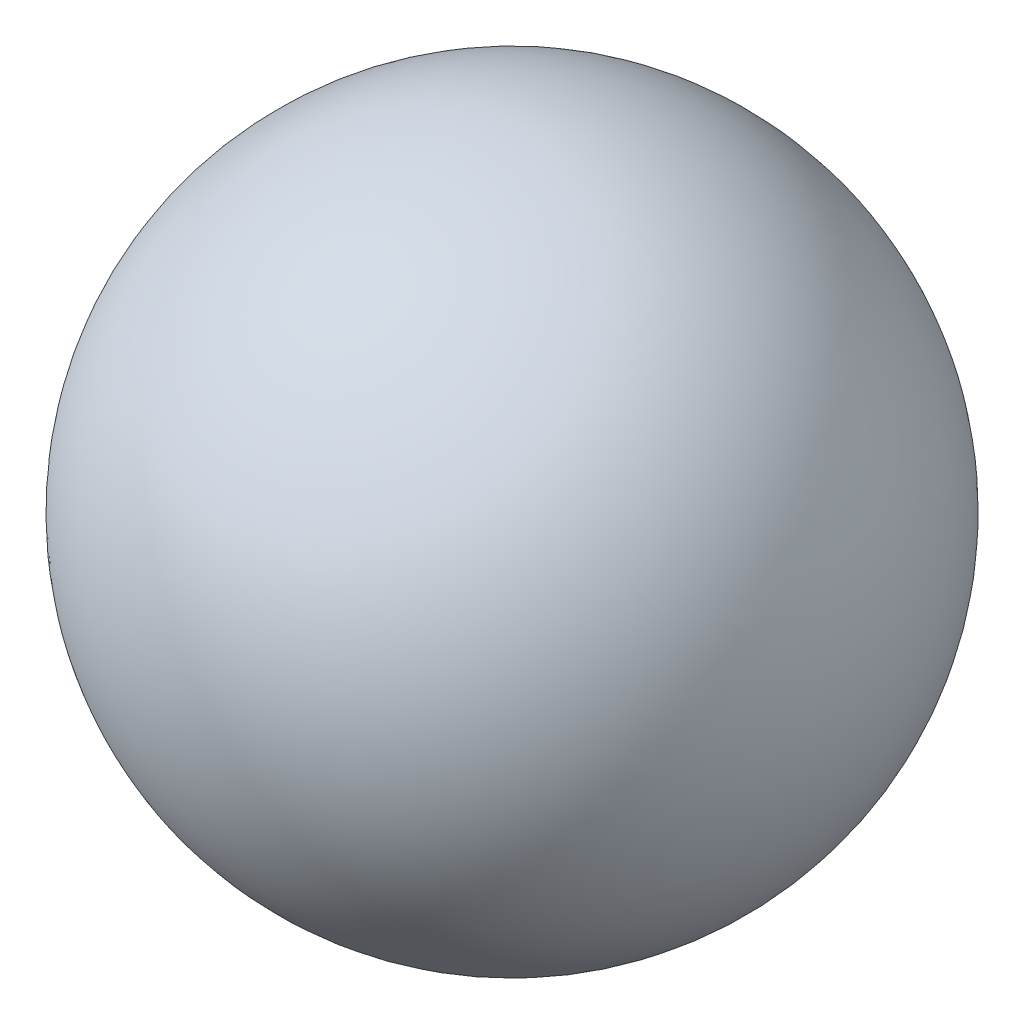
ISO-10303-21;
HEADER;
FILE_DESCRIPTION(('STEP AP214'),'2;1');
FILE_NAME('part.step','',(''),(''),'','','');
FILE_SCHEMA(('AUTOMOTIVE_DESIGN { 1 0 10303 214 1 1 1 1 }'));
ENDSEC;
DATA;
#1=APPLICATION_CONTEXT('core data for automotive mechanical design processes');
#2=APPLICATION_PROTOCOL_DEFINITION('international standard','automotive_design',2000,#1);
#3=PRODUCT_CONTEXT('',#1,'mechanical');
#4=PRODUCT('Part','Part','',(#3));
#5=PRODUCT_RELATED_PRODUCT_CATEGORY('part','',(#4));
#6=PRODUCT_DEFINITION_FORMATION('','',#4);
#7=PRODUCT_DEFINITION_CONTEXT('part definition',#1,'design');
#8=PRODUCT_DEFINITION('design','',#6,#7);
#9=PRODUCT_DEFINITION_SHAPE('','',#8);
#10=(LENGTH_UNIT() NAMED_UNIT(*) SI_UNIT(.MILLI.,.METRE.));
#11=(NAMED_UNIT(*) PLANE_ANGLE_UNIT() SI_UNIT($,.RADIAN.));
#12=(NAMED_UNIT(*) SI_UNIT($,.STERADIAN.) SOLID_ANGLE_UNIT());
#13=UNCERTAINTY_MEASURE_WITH_UNIT(LENGTH_MEASURE(1.E-05),#10,'distance_accuracy_value','');
#14=(GEOMETRIC_REPRESENTATION_CONTEXT(3) GLOBAL_UNCERTAINTY_ASSIGNED_CONTEXT((#13)) GLOBAL_UNIT_ASSIGNED_CONTEXT((#10,
#11,#12)) REPRESENTATION_CONTEXT('',''));
#15=CARTESIAN_POINT('',(0.,0.,0.));
#16=DIRECTION('',(0.,0.,1.));
#17=DIRECTION('',(1.,0.,0.));
#18=AXIS2_PLACEMENT_3D('',#15,#16,#17);
#19=CARTESIAN_POINT('',(0.,0.,0.));
#20=DIRECTION('',(0.,0.,1.));
#21=DIRECTION('',(-1.,0.,0.));
#22=AXIS2_PLACEMENT_3D('',#19,#20,#21);
#23=SPHERICAL_SURFACE('',#22,26.);
#24=CARTESIAN_POINT('',(0.,0.,26.));
#25=VERTEX_POINT('',#24);
#26=VERTEX_LOOP('',#25);
#27=FACE_BOUND('',#26,.T.);
#28=CARTESIAN_POINT('',(0.,0.,-26.));
#29=VERTEX_POINT('',#28);
#30=VERTEX_LOOP('',#29);
#31=FACE_BOUND('',#30,.T.);
#32=ADVANCED_FACE('F15',(#27,#31),#23,.T.);
#33=CLOSED_SHELL('',(#32));
#34=MANIFOLD_SOLID_BREP('B1',#33);
#35=ADVANCED_BREP_SHAPE_REPRESENTATION('',(#18,#34),#14);
#36=SHAPE_DEFINITION_REPRESENTATION(#9,#35);
ENDSEC;
END-ISO-10303-21;
